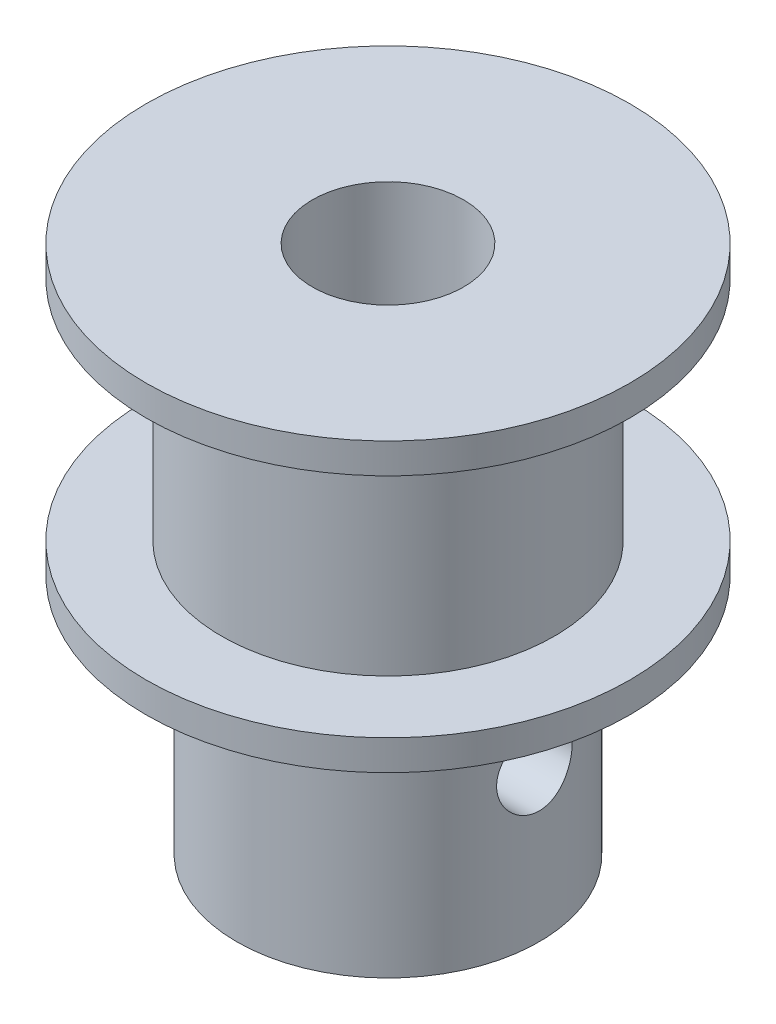
ISO-10303-21;
HEADER;
FILE_DESCRIPTION(('STEP AP214'),'2;1');
FILE_NAME('part.step','',(''),(''),'','','');
FILE_SCHEMA(('AUTOMOTIVE_DESIGN { 1 0 10303 214 1 1 1 1 }'));
ENDSEC;
DATA;
#1=APPLICATION_CONTEXT('core data for automotive mechanical design processes');
#2=APPLICATION_PROTOCOL_DEFINITION('international standard','automotive_design',2000,#1);
#3=PRODUCT_CONTEXT('',#1,'mechanical');
#4=PRODUCT('Part','Part','',(#3));
#5=PRODUCT_RELATED_PRODUCT_CATEGORY('part','',(#4));
#6=PRODUCT_DEFINITION_FORMATION('','',#4);
#7=PRODUCT_DEFINITION_CONTEXT('part definition',#1,'design');
#8=PRODUCT_DEFINITION('design','',#6,#7);
#9=PRODUCT_DEFINITION_SHAPE('','',#8);
#10=(LENGTH_UNIT() NAMED_UNIT(*) SI_UNIT(.MILLI.,.METRE.));
#11=(NAMED_UNIT(*) PLANE_ANGLE_UNIT() SI_UNIT($,.RADIAN.));
#12=(NAMED_UNIT(*) SI_UNIT($,.STERADIAN.) SOLID_ANGLE_UNIT());
#13=UNCERTAINTY_MEASURE_WITH_UNIT(LENGTH_MEASURE(1.E-05),#10,'distance_accuracy_value','');
#14=(GEOMETRIC_REPRESENTATION_CONTEXT(3) GLOBAL_UNCERTAINTY_ASSIGNED_CONTEXT((#13)) GLOBAL_UNIT_ASSIGNED_CONTEXT((#10,
#11,#12)) REPRESENTATION_CONTEXT('',''));
#15=CARTESIAN_POINT('',(0.,0.,0.));
#16=DIRECTION('',(0.,0.,1.));
#17=DIRECTION('',(1.,0.,0.));
#18=AXIS2_PLACEMENT_3D('',#15,#16,#17);
#19=CARTESIAN_POINT('',(0.,0.,0.));
#20=DIRECTION('',(0.,-1.,0.));
#21=DIRECTION('',(0.,0.,-1.));
#22=AXIS2_PLACEMENT_3D('',#19,#20,#21);
#23=CYLINDRICAL_SURFACE('',#22,2.5);
#24=CARTESIAN_POINT('',(2.16506350946109,5.,1.25000000000001));
#25=CARTESIAN_POINT('',(2.16506918410573,4.93486523975594,1.24999545384317));
#26=CARTESIAN_POINT('',(2.16804751484695,4.86964823559369,1.24487496341653));
#27=CARTESIAN_POINT('',(2.17952958065065,4.74121591915356,1.22465401237257));
#28=CARTESIAN_POINT('',(2.18804492569449,4.67800510619574,1.20953258069273));
#29=CARTESIAN_POINT('',(2.20936683256748,4.55568541957007,1.17012493587477));
#30=CARTESIAN_POINT('',(2.22215054341565,4.49655668440802,1.14588744061717));
#31=CARTESIAN_POINT('',(2.25053331021072,4.3832197475041,1.08908440672047));
#32=CARTESIAN_POINT('',(2.2661325184508,4.32901181217193,1.05651841754472));
#33=CARTESIAN_POINT('',(2.29996086321801,4.22211783930312,0.980833175663607));
#34=CARTESIAN_POINT('',(2.31830079547442,4.16992608040807,0.937065045179721));
#35=CARTESIAN_POINT('',(2.35464978482132,4.07323951449161,0.841567259518094));
#36=CARTESIAN_POINT('',(2.37265867289062,4.0287485467706,0.789833657227875));
#37=CARTESIAN_POINT('',(2.40776846191186,3.94579106106542,0.675611954268192));
#38=CARTESIAN_POINT('',(2.42472633022715,3.90793279017559,0.612633986265728));
#39=CARTESIAN_POINT('',(2.45438445124411,3.8435739334428,0.480196283249389));
#40=CARTESIAN_POINT('',(2.46708738979677,3.81706617982854,0.410740672672703));
#41=CARTESIAN_POINT('',(2.48600576555297,3.77811917337363,0.27255617990748));
#42=CARTESIAN_POINT('',(2.49261850276115,3.76481309205558,0.204127238111031));
#43=CARTESIAN_POINT('',(2.50009479807584,3.7497923516562,0.0657132858723191));
#44=CARTESIAN_POINT('',(2.50096183480737,3.74807067900536,-0.00427075730466423));
#45=CARTESIAN_POINT('',(2.49703727395563,3.75593334246294,-0.137290655529679));
#46=CARTESIAN_POINT('',(2.49273119865201,3.76454751940153,-0.20040149897098));
#47=CARTESIAN_POINT('',(2.47967806574684,3.79110105488082,-0.324142214897894));
#48=CARTESIAN_POINT('',(2.47093067582992,3.80904111122028,-0.384771901367398));
#49=CARTESIAN_POINT('',(2.44964479109568,3.85385320761227,-0.502886739461933));
#50=CARTESIAN_POINT('',(2.43705551911499,3.88084539146508,-0.560316779393964));
#51=CARTESIAN_POINT('',(2.40922057483359,3.94282927025187,-0.669971001891652));
#52=CARTESIAN_POINT('',(2.39397395196855,3.97782382912794,-0.722193311048299));
#53=CARTESIAN_POINT('',(2.36055492999037,4.05861918941627,-0.825217076122735));
#54=CARTESIAN_POINT('',(2.34224219997719,4.10512878540751,-0.875417593786692));
#55=CARTESIAN_POINT('',(2.30567925733515,4.20573715616272,-0.967630462872217));
#56=CARTESIAN_POINT('',(2.28742910332036,4.25984171534258,-1.00963651446778));
#57=CARTESIAN_POINT('',(2.25180195115606,4.37831024053011,-1.08688166830276));
#58=CARTESIAN_POINT('',(2.23455399988385,4.44310752881776,-1.12152164372256));
#59=CARTESIAN_POINT('',(2.2046931284822,4.57867208919875,-1.17914889125153));
#60=CARTESIAN_POINT('',(2.19207537557585,4.64943304127195,-1.2021483227636));
#61=CARTESIAN_POINT('',(2.17430794771293,4.78901813910349,-1.23397526378129));
#62=CARTESIAN_POINT('',(2.16864569810621,4.85755139880444,-1.24378140264996));
#63=CARTESIAN_POINT('',(2.16397399202012,4.99550167689568,-1.25189618326428));
#64=CARTESIAN_POINT('',(2.1649598361164,5.06491803639973,-1.25021294664377));
#65=CARTESIAN_POINT('',(2.17292920675731,5.19456739822341,-1.23629505417995));
#66=CARTESIAN_POINT('',(2.17924484383318,5.25497431388491,-1.22523477089058));
#67=CARTESIAN_POINT('',(2.19617526939177,5.3729597328387,-1.19462035579054));
#68=CARTESIAN_POINT('',(2.20679145006293,5.43053731343326,-1.17506347327951));
#69=CARTESIAN_POINT('',(2.23170277599571,5.54426416362837,-1.1270594857561));
#70=CARTESIAN_POINT('',(2.24614554053829,5.60022377106694,-1.0982425796159));
#71=CARTESIAN_POINT('',(2.27695149371562,5.70683658942374,-1.03285883001975));
#72=CARTESIAN_POINT('',(2.29331566693935,5.7574870543916,-0.996288005415263));
#73=CARTESIAN_POINT('',(2.3285999807042,5.85872345940444,-0.911046458998559));
#74=CARTESIAN_POINT('',(2.34758228942862,5.90849643839707,-0.8614315903937));
#75=CARTESIAN_POINT('',(2.38417793722366,5.99926529749199,-0.754255619247853));
#76=CARTESIAN_POINT('',(2.40179081259637,6.04025821278818,-0.696691843319175));
#77=CARTESIAN_POINT('',(2.43426702113696,6.11321715743763,-0.573169203198437));
#78=CARTESIAN_POINT('',(2.44904552090037,6.14491639776364,-0.507028871967632));
#79=CARTESIAN_POINT('',(2.47354193699126,6.19642237982174,-0.369402955801344));
#80=CARTESIAN_POINT('',(2.48326429595466,6.21623956420788,-0.297922126740211));
#81=CARTESIAN_POINT('',(2.49584385227353,6.24171070521833,-0.158724602913012));
#82=CARTESIAN_POINT('',(2.49924909885239,6.24849734484514,-0.0912643048130621));
#83=CARTESIAN_POINT('',(2.50052662968914,6.251054081818,0.0439074824390136));
#84=CARTESIAN_POINT('',(2.49840085083612,6.24682803565446,0.111618875368868));
#85=CARTESIAN_POINT('',(2.48917461047403,6.22822949150547,0.240672490396443));
#86=CARTESIAN_POINT('',(2.48241118334987,6.21454393842791,0.302140397264089));
#87=CARTESIAN_POINT('',(2.46490117079279,6.17834125087129,0.421807440229531));
#88=CARTESIAN_POINT('',(2.45415401415994,6.15582284988318,0.480006106194395));
#89=CARTESIAN_POINT('',(2.4290741343515,6.10159118479253,0.594279257806115));
#90=CARTESIAN_POINT('',(2.41460771498499,6.0695258459902,0.650156428375067));
#91=CARTESIAN_POINT('',(2.38360166427282,5.99755258642619,0.75596830226754));
#92=CARTESIAN_POINT('',(2.3670610819795,5.95764106360541,0.805900259268643));
#93=CARTESIAN_POINT('',(2.33160762783284,5.86650357622162,0.903642505196123));
#94=CARTESIAN_POINT('',(2.31262248764622,5.81454689065351,0.950747105674098));
#95=CARTESIAN_POINT('',(2.27578845203565,5.70318659858779,1.03582910924335));
#96=CARTESIAN_POINT('',(2.25794057202331,5.64377647391539,1.07379843751258));
#97=CARTESIAN_POINT('',(2.22499506631145,5.51670419177381,1.14053884973208));
#98=CARTESIAN_POINT('',(2.21000217820337,5.44884058608908,1.16898133245118));
#99=CARTESIAN_POINT('',(2.18582695410439,5.30833449457528,1.21359838688302));
#100=CARTESIAN_POINT('',(2.17662520184627,5.23570888885914,1.22981398896919));
#101=CARTESIAN_POINT('',(2.16911590752238,5.135243305435,1.24295875983053));
#102=CARTESIAN_POINT('',(2.16760161256439,5.10829013200265,1.24559513120482));
#103=CARTESIAN_POINT('',(2.16557419859687,5.0542293991472,1.24911675636246));
#104=CARTESIAN_POINT('',(2.16506114656386,5.02712182951766,1.25000189299985));
#105=CARTESIAN_POINT('',(2.16506350946109,5.,1.25000000000001));
#106=B_SPLINE_CURVE_WITH_KNOTS('',3,(#24,#25,#26,#27,#28,#29,#30,#31,#32,#33,#34,#35,#36,#37,
#38,#39,#40,#41,#42,#43,#44,#45,#46,#47,#48,#49,#50,#51,#52,#53,#54,#55,#56,#57,#58,#59,#60,#61,
#62,#63,#64,#65,#66,#67,#68,#69,#70,#71,#72,#73,#74,#75,#76,#77,#78,#79,#80,#81,#82,#83,#84,#85,
#86,#87,#88,#89,#90,#91,#92,#93,#94,#95,#96,#97,#98,#99,#100,#101,#102,#103,#104,#105),
.UNSPECIFIED.,.T.,.F.,(4,2,2,2,2,2,2,2,2,2,2,2,2,2,2,2,2,2,2,2,2,2,2,2,2,2,2,2,2,2,2,2,2,2,2,2,
2,2,2,2,4),(0.,0.195290153243395,0.390991116031006,0.585660744898607,0.780340906806438,
0.991077890622793,1.20191963855464,1.42697365298454,1.65188533704864,1.86079356209919,
2.0695752960755,2.26020121855673,2.45084140646819,2.64411918413933,2.8374662418784,
3.04908989321113,3.26087560307398,3.48611052161811,3.71110967764631,3.91827863567765,
4.12530116485466,4.30967729280032,4.49411315545079,4.6870912050761,4.88016857775059,
5.09758429475767,5.31507331222753,5.53830226766207,5.76133474760965,5.96390337986859,
6.16640108492465,6.35555531089366,6.54473666890016,6.7420093839934,6.93937287625899,
7.15637802312585,7.37357428556443,7.59763436298257,7.82093916253451,7.90225168981637,
7.98356965618176),.UNSPECIFIED.);
#107=CARTESIAN_POINT('',(2.16506350946109,5.,1.25000000000001));
#108=VERTEX_POINT('',#107);
#109=EDGE_CURVE('E101',#108,#108,#106,.T.);
#110=ORIENTED_EDGE('',*,*,#109,.T.);
#111=EDGE_LOOP('',(#110));
#112=FACE_BOUND('',#111,.T.);
#113=CARTESIAN_POINT('',(1.25,5.,-2.1650635094611));
#114=CARTESIAN_POINT('',(1.24999545384316,4.93486523975594,-2.16506918410574));
#115=CARTESIAN_POINT('',(1.24487496341652,4.86964823559369,-2.16804751484696));
#116=CARTESIAN_POINT('',(1.22465401237257,4.74121591915356,-2.17952958065065));
#117=CARTESIAN_POINT('',(1.20953258069272,4.67800510619574,-2.18804492569449));
#118=CARTESIAN_POINT('',(1.17012493587477,4.55568541957007,-2.20936683256748));
#119=CARTESIAN_POINT('',(1.14588744061716,4.49655668440802,-2.22215054341565));
#120=CARTESIAN_POINT('',(1.08908440672047,4.3832197475041,-2.25053331021072));
#121=CARTESIAN_POINT('',(1.05651841754472,4.32901181217193,-2.26613251845081));
#122=CARTESIAN_POINT('',(0.980833175663598,4.22211783930312,-2.29996086321802));
#123=CARTESIAN_POINT('',(0.937065045179713,4.16992608040807,-2.31830079547442));
#124=CARTESIAN_POINT('',(0.841567259518085,4.07323951449161,-2.35464978482132));
#125=CARTESIAN_POINT('',(0.789833657227866,4.0287485467706,-2.37265867289062));
#126=CARTESIAN_POINT('',(0.675611954268182,3.94579106106542,-2.40776846191186));
#127=CARTESIAN_POINT('',(0.612633986265718,3.90793279017559,-2.42472633022716));
#128=CARTESIAN_POINT('',(0.48019628324938,3.8435739334428,-2.45438445124411));
#129=CARTESIAN_POINT('',(0.410740672672694,3.81706617982854,-2.46708738979677));
#130=CARTESIAN_POINT('',(0.272556179907472,3.77811917337363,-2.48600576555297));
#131=CARTESIAN_POINT('',(0.204127238111022,3.76481309205558,-2.49261850276115));
#132=CARTESIAN_POINT('',(0.0657132858723103,3.7497923516562,-2.50009479807584));
#133=CARTESIAN_POINT('',(-0.00427075730467304,3.74807067900536,-2.50096183480737));
#134=CARTESIAN_POINT('',(-0.137290655529687,3.75593334246294,-2.49703727395563));
#135=CARTESIAN_POINT('',(-0.200401498970989,3.76454751940153,-2.492731198652));
#136=CARTESIAN_POINT('',(-0.324142214897902,3.79110105488082,-2.47967806574684));
#137=CARTESIAN_POINT('',(-0.384771901367407,3.80904111122028,-2.47093067582992));
#138=CARTESIAN_POINT('',(-0.502886739461942,3.85385320761227,-2.44964479109568));
#139=CARTESIAN_POINT('',(-0.560316779393973,3.88084539146508,-2.43705551911499));
#140=CARTESIAN_POINT('',(-0.669971001891661,3.94282927025187,-2.40922057483359));
#141=CARTESIAN_POINT('',(-0.722193311048307,3.97782382912794,-2.39397395196855));
#142=CARTESIAN_POINT('',(-0.825217076122744,4.05861918941627,-2.36055492999036));
#143=CARTESIAN_POINT('',(-0.875417593786701,4.10512878540751,-2.34224219997719));
#144=CARTESIAN_POINT('',(-0.967630462872225,4.20573715616272,-2.30567925733515));
#145=CARTESIAN_POINT('',(-1.00963651446779,4.25984171534258,-2.28742910332036));
#146=CARTESIAN_POINT('',(-1.08688166830276,4.37831024053011,-2.25180195115606));
#147=CARTESIAN_POINT('',(-1.12152164372256,4.44310752881776,-2.23455399988384));
#148=CARTESIAN_POINT('',(-1.17914889125154,4.57867208919875,-2.2046931284822));
#149=CARTESIAN_POINT('',(-1.20214832276361,4.64943304127195,-2.19207537557584));
#150=CARTESIAN_POINT('',(-1.2339752637813,4.78901813910349,-2.17430794771293));
#151=CARTESIAN_POINT('',(-1.24378140264997,4.85755139880444,-2.1686456981062));
#152=CARTESIAN_POINT('',(-1.25189618326428,4.99550167689568,-2.16397399202012));
#153=CARTESIAN_POINT('',(-1.25021294664378,5.06491803639973,-2.16495983611639));
#154=CARTESIAN_POINT('',(-1.23629505417996,5.19456739822341,-2.17292920675731));
#155=CARTESIAN_POINT('',(-1.22523477089058,5.25497431388491,-2.17924484383318));
#156=CARTESIAN_POINT('',(-1.19462035579055,5.3729597328387,-2.19617526939176));
#157=CARTESIAN_POINT('',(-1.17506347327952,5.43053731343326,-2.20679145006292));
#158=CARTESIAN_POINT('',(-1.12705948575611,5.54426416362837,-2.23170277599571));
#159=CARTESIAN_POINT('',(-1.0982425796159,5.60022377106694,-2.24614554053829));
#160=CARTESIAN_POINT('',(-1.03285883001976,5.70683658942374,-2.27695149371562));
#161=CARTESIAN_POINT('',(-0.996288005415271,5.7574870543916,-2.29331566693934));
#162=CARTESIAN_POINT('',(-0.911046458998567,5.85872345940444,-2.3285999807042));
#163=CARTESIAN_POINT('',(-0.861431590393709,5.90849643839707,-2.34758228942861));
#164=CARTESIAN_POINT('',(-0.754255619247861,5.99926529749199,-2.38417793722366));
#165=CARTESIAN_POINT('',(-0.696691843319184,6.04025821278818,-2.40179081259637));
#166=CARTESIAN_POINT('',(-0.573169203198446,6.11321715743763,-2.43426702113696));
#167=CARTESIAN_POINT('',(-0.507028871967641,6.14491639776364,-2.44904552090037));
#168=CARTESIAN_POINT('',(-0.369402955801352,6.19642237982174,-2.47354193699126));
#169=CARTESIAN_POINT('',(-0.29792212674022,6.21623956420788,-2.48326429595466));
#170=CARTESIAN_POINT('',(-0.158724602913021,6.24171070521833,-2.49584385227353));
#171=CARTESIAN_POINT('',(-0.0912643048130714,6.24849734484514,-2.49924909885239));
#172=CARTESIAN_POINT('',(0.0439074824390044,6.251054081818,-2.50052662968914));
#173=CARTESIAN_POINT('',(0.111618875368858,6.24682803565446,-2.49840085083612));
#174=CARTESIAN_POINT('',(0.240672490396434,6.22822949150547,-2.48917461047403));
#175=CARTESIAN_POINT('',(0.30214039726408,6.21454393842791,-2.48241118334987));
#176=CARTESIAN_POINT('',(0.421807440229522,6.17834125087129,-2.46490117079279));
#177=CARTESIAN_POINT('',(0.480006106194386,6.15582284988318,-2.45415401415995));
#178=CARTESIAN_POINT('',(0.594279257806106,6.10159118479253,-2.4290741343515));
#179=CARTESIAN_POINT('',(0.650156428375059,6.0695258459902,-2.41460771498499));
#180=CARTESIAN_POINT('',(0.755968302267532,5.99755258642619,-2.38360166427283));
#181=CARTESIAN_POINT('',(0.805900259268634,5.95764106360541,-2.36706108197951));
#182=CARTESIAN_POINT('',(0.903642505196114,5.86650357622162,-2.33160762783285));
#183=CARTESIAN_POINT('',(0.95074710567409,5.81454689065351,-2.31262248764622));
#184=CARTESIAN_POINT('',(1.03582910924334,5.70318659858779,-2.27578845203565));
#185=CARTESIAN_POINT('',(1.07379843751257,5.6437764739154,-2.25794057202332));
#186=CARTESIAN_POINT('',(1.14053884973207,5.51670419177381,-2.22499506631145));
#187=CARTESIAN_POINT('',(1.16898133245117,5.44884058608908,-2.21000217820338));
#188=CARTESIAN_POINT('',(1.21359838688301,5.30833449457528,-2.18582695410439));
#189=CARTESIAN_POINT('',(1.22981398896918,5.23570888885914,-2.17662520184627));
#190=CARTESIAN_POINT('',(1.24295875983052,5.135243305435,-2.16911590752238));
#191=CARTESIAN_POINT('',(1.24559513120481,5.10829013200265,-2.1676016125644));
#192=CARTESIAN_POINT('',(1.24911675636245,5.0542293991472,-2.16557419859688));
#193=CARTESIAN_POINT('',(1.25000189299984,5.02712182951766,-2.16506114656387));
#194=CARTESIAN_POINT('',(1.25,5.,-2.1650635094611));
#195=B_SPLINE_CURVE_WITH_KNOTS('',3,(#113,#114,#115,#116,#117,#118,#119,#120,#121,#122,#123,
#124,#125,#126,#127,#128,#129,#130,#131,#132,#133,#134,#135,#136,#137,#138,#139,#140,#141,#142,
#143,#144,#145,#146,#147,#148,#149,#150,#151,#152,#153,#154,#155,#156,#157,#158,#159,#160,#161,
#162,#163,#164,#165,#166,#167,#168,#169,#170,#171,#172,#173,#174,#175,#176,#177,#178,#179,#180,
#181,#182,#183,#184,#185,#186,#187,#188,#189,#190,#191,#192,#193,#194),.UNSPECIFIED.,.T.,.F.,(4,
2,2,2,2,2,2,2,2,2,2,2,2,2,2,2,2,2,2,2,2,2,2,2,2,2,2,2,2,2,2,2,2,2,2,2,2,2,2,2,4),(0.,
0.195290153243395,0.390991116031006,0.585660744898607,0.780340906806438,0.991077890622794,
1.20191963855464,1.42697365298454,1.65188533704864,1.86079356209919,2.0695752960755,
2.26020121855673,2.45084140646819,2.64411918413933,2.8374662418784,3.04908989321113,
3.26087560307398,3.48611052161811,3.71110967764631,3.91827863567765,4.12530116485466,
4.30967729280032,4.49411315545079,4.6870912050761,4.88016857775059,5.09758429475767,
5.31507331222753,5.53830226766207,5.76133474760965,5.96390337986859,6.16640108492465,
6.35555531089366,6.54473666890016,6.7420093839934,6.93937287625899,7.15637802312585,
7.37357428556443,7.59763436298256,7.82093916253451,7.90225168981637,7.98356965618176),.UNSPECIFIED.);
#196=CARTESIAN_POINT('',(1.25,5.,-2.1650635094611));
#197=VERTEX_POINT('',#196);
#198=EDGE_CURVE('E71',#197,#197,#195,.T.);
#199=ORIENTED_EDGE('',*,*,#198,.T.);
#200=EDGE_LOOP('',(#199));
#201=FACE_BOUND('',#200,.T.);
#202=CARTESIAN_POINT('',(0.,0.,0.));
#203=DIRECTION('',(0.,-1.,0.));
#204=DIRECTION('',(0.,0.,-1.));
#205=AXIS2_PLACEMENT_3D('',#202,#203,#204);
#206=CIRCLE('',#205,2.5);
#207=CARTESIAN_POINT('',(0.,0.,-2.5));
#208=VERTEX_POINT('',#207);
#209=EDGE_CURVE('E68',#208,#208,#206,.T.);
#210=ORIENTED_EDGE('',*,*,#209,.T.);
#211=EDGE_LOOP('',(#210));
#212=FACE_BOUND('',#211,.T.);
#213=CARTESIAN_POINT('',(0.,17.5,0.));
#214=DIRECTION('',(0.,-1.,0.));
#215=DIRECTION('',(0.,0.,-1.));
#216=AXIS2_PLACEMENT_3D('',#213,#214,#215);
#217=CIRCLE('',#216,2.5);
#218=CARTESIAN_POINT('',(0.,17.5,-2.5));
#219=VERTEX_POINT('',#218);
#220=EDGE_CURVE('E10',#219,#219,#217,.T.);
#221=ORIENTED_EDGE('',*,*,#220,.F.);
#222=EDGE_LOOP('',(#221));
#223=FACE_BOUND('',#222,.T.);
#224=ADVANCED_FACE('F34',(#112,#201,#212,#223),#23,.F.);
#225=CARTESIAN_POINT('',(2.5,17.5,0.));
#226=DIRECTION('',(0.,1.,0.));
#227=DIRECTION('',(0.,0.,1.));
#228=AXIS2_PLACEMENT_3D('',#225,#226,#227);
#229=PLANE('',#228);
#230=ORIENTED_EDGE('',*,*,#220,.T.);
#231=EDGE_LOOP('',(#230));
#232=FACE_BOUND('',#231,.T.);
#233=CARTESIAN_POINT('',(0.,17.5,0.));
#234=DIRECTION('',(0.,-1.,0.));
#235=DIRECTION('',(0.,0.,-1.));
#236=AXIS2_PLACEMENT_3D('',#233,#234,#235);
#237=CIRCLE('',#236,8.);
#238=CARTESIAN_POINT('',(0.,17.5,-8.));
#239=VERTEX_POINT('',#238);
#240=EDGE_CURVE('E40',#239,#239,#237,.T.);
#241=ORIENTED_EDGE('',*,*,#240,.F.);
#242=EDGE_LOOP('',(#241));
#243=FACE_BOUND('',#242,.T.);
#244=ADVANCED_FACE('F130',(#232,#243),#229,.T.);
#245=CARTESIAN_POINT('',(0.,0.,0.));
#246=DIRECTION('',(0.,-1.,0.));
#247=DIRECTION('',(0.,0.,-1.));
#248=AXIS2_PLACEMENT_3D('',#245,#246,#247);
#249=CYLINDRICAL_SURFACE('',#248,8.);
#250=ORIENTED_EDGE('',*,*,#240,.T.);
#251=EDGE_LOOP('',(#250));
#252=FACE_BOUND('',#251,.T.);
#253=CARTESIAN_POINT('',(0.,16.5,0.));
#254=DIRECTION('',(0.,-1.,0.));
#255=DIRECTION('',(0.,0.,-1.));
#256=AXIS2_PLACEMENT_3D('',#253,#254,#255);
#257=CIRCLE('',#256,8.);
#258=CARTESIAN_POINT('',(0.,16.5,-8.));
#259=VERTEX_POINT('',#258);
#260=EDGE_CURVE('E44',#259,#259,#257,.T.);
#261=ORIENTED_EDGE('',*,*,#260,.F.);
#262=EDGE_LOOP('',(#261));
#263=FACE_BOUND('',#262,.T.);
#264=ADVANCED_FACE('F134',(#252,#263),#249,.T.);
#265=CARTESIAN_POINT('',(8.,16.5,0.));
#266=DIRECTION('',(0.,-1.,0.));
#267=DIRECTION('',(0.,0.,-1.));
#268=AXIS2_PLACEMENT_3D('',#265,#266,#267);
#269=PLANE('',#268);
#270=ORIENTED_EDGE('',*,*,#260,.T.);
#271=EDGE_LOOP('',(#270));
#272=FACE_BOUND('',#271,.T.);
#273=CARTESIAN_POINT('',(0.,16.5,0.));
#274=DIRECTION('',(0.,-1.,0.));
#275=DIRECTION('',(0.,0.,-1.));
#276=AXIS2_PLACEMENT_3D('',#273,#274,#275);
#277=CIRCLE('',#276,5.5);
#278=CARTESIAN_POINT('',(0.,16.5,-5.5));
#279=VERTEX_POINT('',#278);
#280=EDGE_CURVE('E48',#279,#279,#277,.T.);
#281=ORIENTED_EDGE('',*,*,#280,.F.);
#282=EDGE_LOOP('',(#281));
#283=FACE_BOUND('',#282,.T.);
#284=ADVANCED_FACE('F208',(#272,#283),#269,.T.);
#285=CARTESIAN_POINT('',(0.,0.,0.));
#286=DIRECTION('',(0.,-1.,0.));
#287=DIRECTION('',(0.,0.,-1.));
#288=AXIS2_PLACEMENT_3D('',#285,#286,#287);
#289=CYLINDRICAL_SURFACE('',#288,5.5);
#290=ORIENTED_EDGE('',*,*,#280,.T.);
#291=EDGE_LOOP('',(#290));
#292=FACE_BOUND('',#291,.T.);
#293=CARTESIAN_POINT('',(0.,9.,0.));
#294=DIRECTION('',(0.,-1.,0.));
#295=DIRECTION('',(0.,0.,-1.));
#296=AXIS2_PLACEMENT_3D('',#293,#294,#295);
#297=CIRCLE('',#296,5.5);
#298=CARTESIAN_POINT('',(0.,9.,-5.5));
#299=VERTEX_POINT('',#298);
#300=EDGE_CURVE('E53',#299,#299,#297,.T.);
#301=ORIENTED_EDGE('',*,*,#300,.F.);
#302=EDGE_LOOP('',(#301));
#303=FACE_BOUND('',#302,.T.);
#304=ADVANCED_FACE('F198',(#292,#303),#289,.T.);
#305=CARTESIAN_POINT('',(5.5,9.,0.));
#306=DIRECTION('',(0.,1.,0.));
#307=DIRECTION('',(0.,0.,1.));
#308=AXIS2_PLACEMENT_3D('',#305,#306,#307);
#309=PLANE('',#308);
#310=ORIENTED_EDGE('',*,*,#300,.T.);
#311=EDGE_LOOP('',(#310));
#312=FACE_BOUND('',#311,.T.);
#313=CARTESIAN_POINT('',(0.,9.,0.));
#314=DIRECTION('',(0.,-1.,0.));
#315=DIRECTION('',(0.,0.,-1.));
#316=AXIS2_PLACEMENT_3D('',#313,#314,#315);
#317=CIRCLE('',#316,8.);
#318=CARTESIAN_POINT('',(0.,9.,-8.));
#319=VERTEX_POINT('',#318);
#320=EDGE_CURVE('E56',#319,#319,#317,.T.);
#321=ORIENTED_EDGE('',*,*,#320,.F.);
#322=EDGE_LOOP('',(#321));
#323=FACE_BOUND('',#322,.T.);
#324=ADVANCED_FACE('F188',(#312,#323),#309,.T.);
#325=CARTESIAN_POINT('',(0.,0.,0.));
#326=DIRECTION('',(0.,-1.,0.));
#327=DIRECTION('',(0.,0.,-1.));
#328=AXIS2_PLACEMENT_3D('',#325,#326,#327);
#329=CYLINDRICAL_SURFACE('',#328,8.);
#330=ORIENTED_EDGE('',*,*,#320,.T.);
#331=EDGE_LOOP('',(#330));
#332=FACE_BOUND('',#331,.T.);
#333=CARTESIAN_POINT('',(0.,8.,0.));
#334=DIRECTION('',(0.,-1.,0.));
#335=DIRECTION('',(0.,0.,-1.));
#336=AXIS2_PLACEMENT_3D('',#333,#334,#335);
#337=CIRCLE('',#336,8.);
#338=CARTESIAN_POINT('',(0.,8.,-8.));
#339=VERTEX_POINT('',#338);
#340=EDGE_CURVE('E59',#339,#339,#337,.T.);
#341=ORIENTED_EDGE('',*,*,#340,.F.);
#342=EDGE_LOOP('',(#341));
#343=FACE_BOUND('',#342,.T.);
#344=ADVANCED_FACE('F178',(#332,#343),#329,.T.);
#345=CARTESIAN_POINT('',(8.,8.,0.));
#346=DIRECTION('',(0.,-1.,0.));
#347=DIRECTION('',(0.,0.,-1.));
#348=AXIS2_PLACEMENT_3D('',#345,#346,#347);
#349=PLANE('',#348);
#350=ORIENTED_EDGE('',*,*,#340,.T.);
#351=EDGE_LOOP('',(#350));
#352=FACE_BOUND('',#351,.T.);
#353=CARTESIAN_POINT('',(0.,8.,0.));
#354=DIRECTION('',(0.,-1.,0.));
#355=DIRECTION('',(0.,0.,-1.));
#356=AXIS2_PLACEMENT_3D('',#353,#354,#355);
#357=CIRCLE('',#356,5.);
#358=CARTESIAN_POINT('',(0.,8.,-5.));
#359=VERTEX_POINT('',#358);
#360=EDGE_CURVE('E62',#359,#359,#357,.T.);
#361=ORIENTED_EDGE('',*,*,#360,.F.);
#362=EDGE_LOOP('',(#361));
#363=FACE_BOUND('',#362,.T.);
#364=ADVANCED_FACE('F116',(#352,#363),#349,.T.);
#365=CARTESIAN_POINT('',(0.,0.,0.));
#366=DIRECTION('',(0.,-1.,0.));
#367=DIRECTION('',(0.,0.,-1.));
#368=AXIS2_PLACEMENT_3D('',#365,#366,#367);
#369=CYLINDRICAL_SURFACE('',#368,5.);
#370=CARTESIAN_POINT('',(4.84122918275927,5.,1.25000000000002));
#371=CARTESIAN_POINT('',(4.84123050042654,5.0690253754623,1.24999803929591));
#372=CARTESIAN_POINT('',(4.84272153006956,5.138072449339,1.24426312274867));
#373=CARTESIAN_POINT('',(4.84850930996624,5.27418378908702,1.22151156273209));
#374=CARTESIAN_POINT('',(4.85280769310906,5.34124687723416,1.20448835337112));
#375=CARTESIAN_POINT('',(4.86369362297983,5.47140176909352,1.15974559981599));
#376=CARTESIAN_POINT('',(4.87027821345204,5.53449857769284,1.13203986392725));
#377=CARTESIAN_POINT('',(4.88499096014404,5.65515542626996,1.06676057063072));
#378=CARTESIAN_POINT('',(4.89311918189251,5.71271523104011,1.02918659428036));
#379=CARTESIAN_POINT('',(4.91020358177805,5.8219308226311,0.944354213655954));
#380=CARTESIAN_POINT('',(4.91917298811515,5.87344680017502,0.896918443852042));
#381=CARTESIAN_POINT('',(4.93681437757648,5.96788069718017,0.794091032050349));
#382=CARTESIAN_POINT('',(4.94548633283194,6.01079781281087,0.738698647090171));
#383=CARTESIAN_POINT('',(4.96170207760291,6.08738773381564,0.620572600539494));
#384=CARTESIAN_POINT('',(4.96922843700296,6.12092319408073,0.557747288097577));
#385=CARTESIAN_POINT('',(4.98215405962992,6.17690482207654,0.427131592146399));
#386=CARTESIAN_POINT('',(4.98755363667172,6.19935262595776,0.359341942895988));
#387=CARTESIAN_POINT('',(4.9955237942409,6.23207391728929,0.222179379377099));
#388=CARTESIAN_POINT('',(4.99814946922157,6.24258482216329,0.152866359774505));
#389=CARTESIAN_POINT('',(5.00046797053649,6.25187918963778,0.0134144096314023));
#390=CARTESIAN_POINT('',(5.00016123048352,6.2506643861048,-0.0567243972690167));
#391=CARTESIAN_POINT('',(4.99669047476767,6.23671257487493,-0.194190308965467));
#392=CARTESIAN_POINT('',(4.99359001170437,6.22423183747307,-0.261545269501316));
#393=CARTESIAN_POINT('',(4.98495418262427,6.18851436497575,-0.39317280926709));
#394=CARTESIAN_POINT('',(4.97941868699221,6.1652770573113,-0.45744522421303));
#395=CARTESIAN_POINT('',(4.96643754850448,6.10849871465647,-0.581758379377241));
#396=CARTESIAN_POINT('',(4.95897509847527,6.07486647766913,-0.641755637208114));
#397=CARTESIAN_POINT('',(4.94294951904825,5.99832216044187,-0.755344527925594));
#398=CARTESIAN_POINT('',(4.93438619826245,5.95540846571969,-0.808935043856865));
#399=CARTESIAN_POINT('',(4.91681856884761,5.86014562900881,-0.909717543856179));
#400=CARTESIAN_POINT('',(4.90780859762959,5.80757255382611,-0.956697098843982));
#401=CARTESIAN_POINT('',(4.89057521758354,5.69520001322987,-1.04122046995376));
#402=CARTESIAN_POINT('',(4.88235184552986,5.6354002102545,-1.0787638450575));
#403=CARTESIAN_POINT('',(4.86760248415825,5.50985498292552,-1.14348516127823));
#404=CARTESIAN_POINT('',(4.86108491862861,5.4440821348434,-1.1706119587131));
#405=CARTESIAN_POINT('',(4.85059320069979,5.30870726596177,-1.21335702579541));
#406=CARTESIAN_POINT('',(4.8466185040511,5.23910606800843,-1.22897775819112));
#407=CARTESIAN_POINT('',(4.84177678019571,5.10002024923844,-1.24791481933257));
#408=CARTESIAN_POINT('',(4.84083044546825,5.03058110333519,-1.2515452369598));
#409=CARTESIAN_POINT('',(4.8419367174052,4.89208903171092,-1.24725849525776));
#410=CARTESIAN_POINT('',(4.84398904800633,4.82303607102438,-1.23934239892438));
#411=CARTESIAN_POINT('',(4.85078540977281,4.68844286752265,-1.21246273196881));
#412=CARTESIAN_POINT('',(4.85548485117188,4.62286363671458,-1.19368203414086));
#413=CARTESIAN_POINT('',(4.86700359135482,4.49578427107416,-1.14580904083529));
#414=CARTESIAN_POINT('',(4.87382314124307,4.43428462047233,-1.11671552385626));
#415=CARTESIAN_POINT('',(4.88898068546632,4.31577936106633,-1.04838533396826));
#416=CARTESIAN_POINT('',(4.89734584303321,4.25888557997845,-1.0089608769178));
#417=CARTESIAN_POINT('',(4.91458541535858,4.15240581859932,-0.921325366168052));
#418=CARTESIAN_POINT('',(4.92345991364235,4.10282104167496,-0.873112868506782));
#419=CARTESIAN_POINT('',(4.94098701515803,4.01109447871452,-0.767828401230889));
#420=CARTESIAN_POINT('',(4.94962851030918,3.96916996872559,-0.710564940664473));
#421=CARTESIAN_POINT('',(4.96548608306867,3.89553206652438,-0.589628353368326));
#422=CARTESIAN_POINT('',(4.9727022350198,3.8638181416959,-0.525955561196971));
#423=CARTESIAN_POINT('',(4.98485057869157,3.81177698273603,-0.394447752163845));
#424=CARTESIAN_POINT('',(4.98979915011205,3.79136785781047,-0.326646726284834));
#425=CARTESIAN_POINT('',(4.99692646697894,3.76226983269579,-0.188437200398492));
#426=CARTESIAN_POINT('',(4.99910574696704,3.75357867063047,-0.118029206301537));
#427=CARTESIAN_POINT('',(5.00042711761014,3.74829051303058,0.0213544080541759));
#428=CARTESIAN_POINT('',(4.9996497360001,3.75137286363076,0.0903172837075593));
#429=CARTESIAN_POINT('',(4.9953237057178,3.76880978411791,0.226709370518442));
#430=CARTESIAN_POINT('',(4.99177513946369,3.78316401876638,0.294138627226126));
#431=CARTESIAN_POINT('',(4.98231791067453,3.82256527471366,0.425213794556038));
#432=CARTESIAN_POINT('',(4.97642205628333,3.84755431664328,0.488878118226291));
#433=CARTESIAN_POINT('',(4.9628911114173,3.90746322377416,0.611146316301853));
#434=CARTESIAN_POINT('',(4.9552558017217,3.94238434083696,0.669749551581332));
#435=CARTESIAN_POINT('',(4.93884062101666,4.02214404249634,0.781752410529892));
#436=CARTESIAN_POINT('',(4.93003771182014,4.06720017863422,0.834993735375748));
#437=CARTESIAN_POINT('',(4.91238311316552,4.16552856496725,0.933268775339087));
#438=CARTESIAN_POINT('',(4.90353141190695,4.21880289512238,0.978300406335254));
#439=CARTESIAN_POINT('',(4.88659344825685,4.33325176775167,1.05970253309905));
#440=CARTESIAN_POINT('',(4.87852454662355,4.39455515426578,1.0958957743082));
#441=CARTESIAN_POINT('',(4.86429944438269,4.52256936240338,1.1574086207696));
#442=CARTESIAN_POINT('',(4.85814185308378,4.58927620763343,1.18273613719967));
#443=CARTESIAN_POINT('',(4.84939885924729,4.7132212647834,1.21802816070682));
#444=CARTESIAN_POINT('',(4.84635828750683,4.76986645547983,1.22999146324424));
#445=CARTESIAN_POINT('',(4.84227298231965,4.88433608624995,1.2459778657166));
#446=CARTESIAN_POINT('',(4.84122807862453,4.94216042530633,1.25000164296525));
#447=CARTESIAN_POINT('',(4.84122918275927,5.,1.25000000000002));
#448=B_SPLINE_CURVE_WITH_KNOTS('',3,(#370,#371,#372,#373,#374,#375,#376,#377,#378,#379,#380,
#381,#382,#383,#384,#385,#386,#387,#388,#389,#390,#391,#392,#393,#394,#395,#396,#397,#398,#399,
#400,#401,#402,#403,#404,#405,#406,#407,#408,#409,#410,#411,#412,#413,#414,#415,#416,#417,#418,
#419,#420,#421,#422,#423,#424,#425,#426,#427,#428,#429,#430,#431,#432,#433,#434,#435,#436,#437,
#438,#439,#440,#441,#442,#443,#444,#445,#446,#447),.UNSPECIFIED.,.T.,.F.,(4,2,2,2,2,2,2,2,2,2,2,
2,2,2,2,2,2,2,2,2,2,2,2,2,2,2,2,2,2,2,2,2,2,2,2,2,2,2,4),(0.,0.206863720868067,
0.413847870714333,0.620565363583011,0.827291633777393,1.03811977096488,1.24896760739933,
1.4627574819896,1.67651579923546,1.88594375497673,2.0953407433301,2.30009131344474,
2.50485278362393,2.71146437127222,2.91811192734457,3.13035233285956,3.34260265599901,
3.55588216004201,3.76911600064774,3.97671787380859,4.18430063591901,4.38848702504604,
4.59269760710709,4.80091422929579,5.00916509442523,5.2226266548266,5.43607707859777,
5.64796036403465,5.85980274454519,6.06591723063729,6.27202558688491,6.47702438279856,
6.68204902869036,6.89198548291036,7.10197515782755,7.31588238642339,7.5296336068331,
7.70298913588665,7.87632987549761),.UNSPECIFIED.);
#449=CARTESIAN_POINT('',(4.84122918275927,5.,1.25000000000002));
#450=VERTEX_POINT('',#449);
#451=EDGE_CURVE('E98',#450,#450,#448,.T.);
#452=ORIENTED_EDGE('',*,*,#451,.T.);
#453=EDGE_LOOP('',(#452));
#454=FACE_BOUND('',#453,.T.);
#455=CARTESIAN_POINT('',(1.25,5.,-4.84122918275927));
#456=CARTESIAN_POINT('',(1.24999803929589,5.0690253754623,-4.84123050042654));
#457=CARTESIAN_POINT('',(1.24426312274865,5.138072449339,-4.84272153006957));
#458=CARTESIAN_POINT('',(1.22151156273207,5.27418378908702,-4.84850930996624));
#459=CARTESIAN_POINT('',(1.2044883533711,5.34124687723416,-4.85280769310907));
#460=CARTESIAN_POINT('',(1.15974559981597,5.47140176909352,-4.86369362297984));
#461=CARTESIAN_POINT('',(1.13203986392723,5.53449857769284,-4.87027821345204));
#462=CARTESIAN_POINT('',(1.0667605706307,5.65515542626996,-4.88499096014404));
#463=CARTESIAN_POINT('',(1.02918659428035,5.71271523104011,-4.89311918189251));
#464=CARTESIAN_POINT('',(0.944354213655937,5.8219308226311,-4.91020358177806));
#465=CARTESIAN_POINT('',(0.896918443852024,5.87344680017502,-4.91917298811515));
#466=CARTESIAN_POINT('',(0.794091032050331,5.96788069718017,-4.93681437757649));
#467=CARTESIAN_POINT('',(0.738698647090152,6.01079781281087,-4.94548633283195));
#468=CARTESIAN_POINT('',(0.620572600539476,6.08738773381564,-4.96170207760291));
#469=CARTESIAN_POINT('',(0.557747288097559,6.12092319408073,-4.96922843700296));
#470=CARTESIAN_POINT('',(0.427131592146381,6.17690482207654,-4.98215405962992));
#471=CARTESIAN_POINT('',(0.35934194289597,6.19935262595776,-4.98755363667172));
#472=CARTESIAN_POINT('',(0.222179379377081,6.23207391728929,-4.9955237942409));
#473=CARTESIAN_POINT('',(0.152866359774488,6.24258482216329,-4.99814946922157));
#474=CARTESIAN_POINT('',(0.0134144096313846,6.25187918963778,-5.00046797053649));
#475=CARTESIAN_POINT('',(-0.0567243972690342,6.2506643861048,-5.00016123048352));
#476=CARTESIAN_POINT('',(-0.194190308965484,6.23671257487493,-4.99669047476767));
#477=CARTESIAN_POINT('',(-0.261545269501334,6.22423183747307,-4.99359001170437));
#478=CARTESIAN_POINT('',(-0.393172809267108,6.18851436497575,-4.98495418262427));
#479=CARTESIAN_POINT('',(-0.457445224213047,6.1652770573113,-4.97941868699221));
#480=CARTESIAN_POINT('',(-0.581758379377258,6.10849871465647,-4.96643754850448));
#481=CARTESIAN_POINT('',(-0.64175563720813,6.07486647766913,-4.95897509847527));
#482=CARTESIAN_POINT('',(-0.755344527925611,5.99832216044187,-4.94294951904825));
#483=CARTESIAN_POINT('',(-0.808935043856882,5.95540846571969,-4.93438619826245));
#484=CARTESIAN_POINT('',(-0.909717543856195,5.86014562900881,-4.9168185688476));
#485=CARTESIAN_POINT('',(-0.956697098843999,5.80757255382611,-4.90780859762959));
#486=CARTESIAN_POINT('',(-1.04122046995377,5.69520001322987,-4.89057521758353));
#487=CARTESIAN_POINT('',(-1.07876384505752,5.6354002102545,-4.88235184552985));
#488=CARTESIAN_POINT('',(-1.14348516127825,5.50985498292552,-4.86760248415824));
#489=CARTESIAN_POINT('',(-1.17061195871311,5.4440821348434,-4.8610849186286));
#490=CARTESIAN_POINT('',(-1.21335702579543,5.30870726596177,-4.85059320069979));
#491=CARTESIAN_POINT('',(-1.22897775819114,5.23910606800843,-4.84661850405109));
#492=CARTESIAN_POINT('',(-1.24791481933259,5.10002024923844,-4.8417767801957));
#493=CARTESIAN_POINT('',(-1.25154523695981,5.03058110333519,-4.84083044546824));
#494=CARTESIAN_POINT('',(-1.24725849525777,4.89208903171092,-4.8419367174052));
#495=CARTESIAN_POINT('',(-1.2393423989244,4.82303607102438,-4.84398904800633));
#496=CARTESIAN_POINT('',(-1.21246273196883,4.68844286752265,-4.8507854097728));
#497=CARTESIAN_POINT('',(-1.19368203414087,4.62286363671458,-4.85548485117188));
#498=CARTESIAN_POINT('',(-1.14580904083531,4.49578427107416,-4.86700359135481));
#499=CARTESIAN_POINT('',(-1.11671552385627,4.43428462047233,-4.87382314124307));
#500=CARTESIAN_POINT('',(-1.04838533396828,4.31577936106633,-4.88898068546631));
#501=CARTESIAN_POINT('',(-1.00896087691781,4.25888557997845,-4.89734584303321));
#502=CARTESIAN_POINT('',(-0.921325366168069,4.15240581859932,-4.91458541535858));
#503=CARTESIAN_POINT('',(-0.873112868506799,4.10282104167496,-4.92345991364235));
#504=CARTESIAN_POINT('',(-0.767828401230907,4.01109447871452,-4.94098701515803));
#505=CARTESIAN_POINT('',(-0.710564940664491,3.96916996872559,-4.94962851030918));
#506=CARTESIAN_POINT('',(-0.589628353368344,3.89553206652438,-4.96548608306867));
#507=CARTESIAN_POINT('',(-0.525955561196989,3.8638181416959,-4.9727022350198));
#508=CARTESIAN_POINT('',(-0.394447752163863,3.81177698273603,-4.98485057869157));
#509=CARTESIAN_POINT('',(-0.326646726284852,3.79136785781047,-4.98979915011205));
#510=CARTESIAN_POINT('',(-0.18843720039851,3.76226983269579,-4.99692646697894));
#511=CARTESIAN_POINT('',(-0.118029206301555,3.75357867063047,-4.99910574696704));
#512=CARTESIAN_POINT('',(0.0213544080541577,3.74829051303058,-5.00042711761014));
#513=CARTESIAN_POINT('',(0.090317283707541,3.75137286363076,-4.99964973600011));
#514=CARTESIAN_POINT('',(0.226709370518424,3.76880978411791,-4.9953237057178));
#515=CARTESIAN_POINT('',(0.294138627226108,3.78316401876638,-4.99177513946369));
#516=CARTESIAN_POINT('',(0.42521379455602,3.82256527471366,-4.98231791067453));
#517=CARTESIAN_POINT('',(0.488878118226274,3.84755431664328,-4.97642205628333));
#518=CARTESIAN_POINT('',(0.611146316301836,3.90746322377416,-4.9628911114173));
#519=CARTESIAN_POINT('',(0.669749551581314,3.94238434083696,-4.9552558017217));
#520=CARTESIAN_POINT('',(0.781752410529874,4.02214404249634,-4.93884062101666));
#521=CARTESIAN_POINT('',(0.83499373537573,4.06720017863422,-4.93003771182014));
#522=CARTESIAN_POINT('',(0.933268775339069,4.16552856496725,-4.91238311316553));
#523=CARTESIAN_POINT('',(0.978300406335237,4.21880289512238,-4.90353141190695));
#524=CARTESIAN_POINT('',(1.05970253309904,4.33325176775166,-4.88659344825685));
#525=CARTESIAN_POINT('',(1.09589577430819,4.39455515426578,-4.87852454662356));
#526=CARTESIAN_POINT('',(1.15740862076958,4.52256936240338,-4.8642994443827));
#527=CARTESIAN_POINT('',(1.18273613719965,4.58927620763343,-4.85814185308379));
#528=CARTESIAN_POINT('',(1.2180281607068,4.7132212647834,-4.84939885924729));
#529=CARTESIAN_POINT('',(1.22999146324422,4.76986645547983,-4.84635828750683));
#530=CARTESIAN_POINT('',(1.24597786571659,4.88433608624995,-4.84227298231965));
#531=CARTESIAN_POINT('',(1.25000164296523,4.94216042530633,-4.84122807862454));
#532=CARTESIAN_POINT('',(1.25,5.,-4.84122918275927));
#533=B_SPLINE_CURVE_WITH_KNOTS('',3,(#455,#456,#457,#458,#459,#460,#461,#462,#463,#464,#465,
#466,#467,#468,#469,#470,#471,#472,#473,#474,#475,#476,#477,#478,#479,#480,#481,#482,#483,#484,
#485,#486,#487,#488,#489,#490,#491,#492,#493,#494,#495,#496,#497,#498,#499,#500,#501,#502,#503,
#504,#505,#506,#507,#508,#509,#510,#511,#512,#513,#514,#515,#516,#517,#518,#519,#520,#521,#522,
#523,#524,#525,#526,#527,#528,#529,#530,#531,#532),.UNSPECIFIED.,.T.,.F.,(4,2,2,2,2,2,2,2,2,2,2,
2,2,2,2,2,2,2,2,2,2,2,2,2,2,2,2,2,2,2,2,2,2,2,2,2,2,2,4),(0.,0.206863720868067,
0.413847870714333,0.620565363583011,0.827291633777393,1.03811977096488,1.24896760739933,
1.4627574819896,1.67651579923546,1.88594375497673,2.0953407433301,2.30009131344474,
2.50485278362393,2.71146437127222,2.91811192734457,3.13035233285956,3.34260265599901,
3.55588216004201,3.76911600064774,3.97671787380859,4.18430063591901,4.38848702504604,
4.59269760710709,4.80091422929579,5.00916509442522,5.2226266548266,5.43607707859777,
5.64796036403465,5.85980274454519,6.06591723063729,6.27202558688491,6.47702438279856,
6.68204902869036,6.89198548291036,7.10197515782755,7.31588238642339,7.5296336068331,
7.70298913588665,7.87632987549761),.UNSPECIFIED.);
#534=CARTESIAN_POINT('',(1.25,5.,-4.84122918275927));
#535=VERTEX_POINT('',#534);
#536=EDGE_CURVE('E78',#535,#535,#533,.T.);
#537=ORIENTED_EDGE('',*,*,#536,.T.);
#538=EDGE_LOOP('',(#537));
#539=FACE_BOUND('',#538,.T.);
#540=ORIENTED_EDGE('',*,*,#360,.T.);
#541=EDGE_LOOP('',(#540));
#542=FACE_BOUND('',#541,.T.);
#543=CARTESIAN_POINT('',(0.,0.,0.));
#544=DIRECTION('',(0.,-1.,0.));
#545=DIRECTION('',(0.,0.,-1.));
#546=AXIS2_PLACEMENT_3D('',#543,#544,#545);
#547=CIRCLE('',#546,5.);
#548=CARTESIAN_POINT('',(0.,0.,-5.));
#549=VERTEX_POINT('',#548);
#550=EDGE_CURVE('E65',#549,#549,#547,.T.);
#551=ORIENTED_EDGE('',*,*,#550,.F.);
#552=EDGE_LOOP('',(#551));
#553=FACE_BOUND('',#552,.T.);
#554=ADVANCED_FACE('F111',(#454,#539,#542,#553),#369,.T.);
#555=CARTESIAN_POINT('',(5.,0.,0.));
#556=DIRECTION('',(0.,-1.,0.));
#557=DIRECTION('',(0.,0.,-1.));
#558=AXIS2_PLACEMENT_3D('',#555,#556,#557);
#559=PLANE('',#558);
#560=ORIENTED_EDGE('',*,*,#550,.T.);
#561=EDGE_LOOP('',(#560));
#562=FACE_BOUND('',#561,.T.);
#563=ORIENTED_EDGE('',*,*,#209,.F.);
#564=EDGE_LOOP('',(#563));
#565=FACE_BOUND('',#564,.T.);
#566=ADVANCED_FACE('F115',(#562,#565),#559,.T.);
#567=CARTESIAN_POINT('',(0.,5.,-8.001));
#568=DIRECTION('',(0.,0.,1.));
#569=DIRECTION('',(1.,0.,0.));
#570=AXIS2_PLACEMENT_3D('',#567,#568,#569);
#571=CYLINDRICAL_SURFACE('',#570,1.25);
#572=ORIENTED_EDGE('',*,*,#198,.F.);
#573=EDGE_LOOP('',(#572));
#574=FACE_BOUND('',#573,.T.);
#575=ORIENTED_EDGE('',*,*,#536,.F.);
#576=EDGE_LOOP('',(#575));
#577=FACE_BOUND('',#576,.T.);
#578=ADVANCED_FACE('F83',(#574,#577),#571,.F.);
#579=CARTESIAN_POINT('',(8.00100000000003,5.,0.));
#580=DIRECTION('',(-1.,0.,0.));
#581=DIRECTION('',(0.,0.,1.));
#582=AXIS2_PLACEMENT_3D('',#579,#580,#581);
#583=CYLINDRICAL_SURFACE('',#582,1.25);
#584=ORIENTED_EDGE('',*,*,#109,.F.);
#585=EDGE_LOOP('',(#584));
#586=FACE_BOUND('',#585,.T.);
#587=ORIENTED_EDGE('',*,*,#451,.F.);
#588=EDGE_LOOP('',(#587));
#589=FACE_BOUND('',#588,.T.);
#590=ADVANCED_FACE('F89',(#586,#589),#583,.F.);
#591=CLOSED_SHELL('',(#224,#244,#264,#284,#304,#324,#344,#364,#554,#566,#578,#590));
#592=MANIFOLD_SOLID_BREP('B2',#591);
#593=ADVANCED_BREP_SHAPE_REPRESENTATION('',(#18,#592),#14);
#594=SHAPE_DEFINITION_REPRESENTATION(#9,#593);
ENDSEC;
END-ISO-10303-21;
